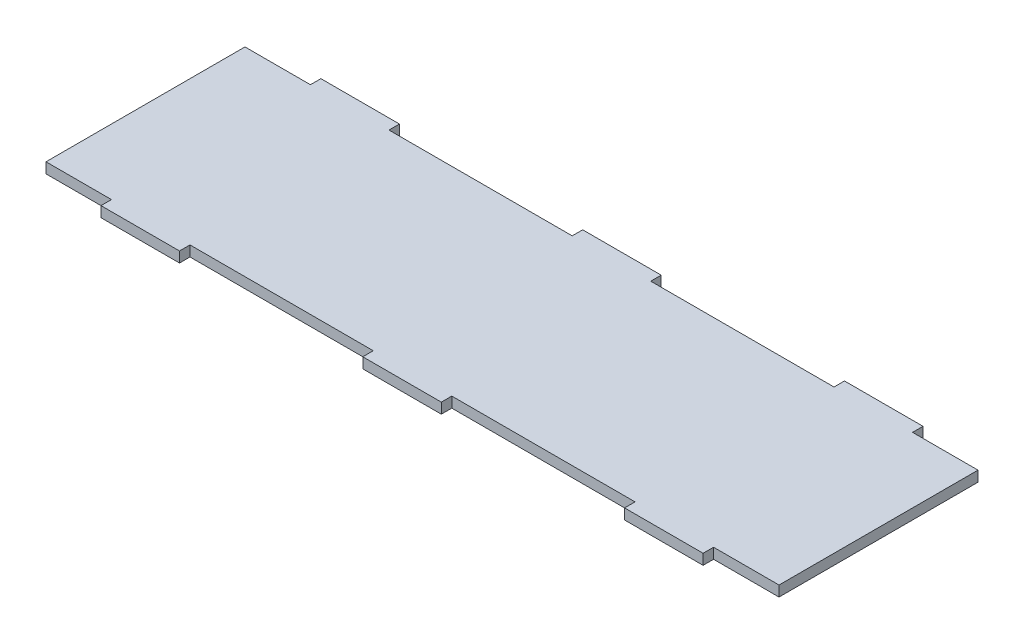
ISO-10303-21;
HEADER;
FILE_DESCRIPTION(('STEP AP214'),'2;1');
FILE_NAME('part.step','',(''),(''),'','','');
FILE_SCHEMA(('AUTOMOTIVE_DESIGN { 1 0 10303 214 1 1 1 1 }'));
ENDSEC;
DATA;
#1=APPLICATION_CONTEXT('core data for automotive mechanical design processes');
#2=APPLICATION_PROTOCOL_DEFINITION('international standard','automotive_design',2000,#1);
#3=PRODUCT_CONTEXT('',#1,'mechanical');
#4=PRODUCT('Part','Part','',(#3));
#5=PRODUCT_RELATED_PRODUCT_CATEGORY('part','',(#4));
#6=PRODUCT_DEFINITION_FORMATION('','',#4);
#7=PRODUCT_DEFINITION_CONTEXT('part definition',#1,'design');
#8=PRODUCT_DEFINITION('design','',#6,#7);
#9=PRODUCT_DEFINITION_SHAPE('','',#8);
#10=(LENGTH_UNIT() NAMED_UNIT(*) SI_UNIT(.MILLI.,.METRE.));
#11=(NAMED_UNIT(*) PLANE_ANGLE_UNIT() SI_UNIT($,.RADIAN.));
#12=(NAMED_UNIT(*) SI_UNIT($,.STERADIAN.) SOLID_ANGLE_UNIT());
#13=UNCERTAINTY_MEASURE_WITH_UNIT(LENGTH_MEASURE(1.E-05),#10,'distance_accuracy_value','');
#14=(GEOMETRIC_REPRESENTATION_CONTEXT(3) GLOBAL_UNCERTAINTY_ASSIGNED_CONTEXT((#13)) GLOBAL_UNIT_ASSIGNED_CONTEXT((#10,
#11,#12)) REPRESENTATION_CONTEXT('',''));
#15=CARTESIAN_POINT('',(0.,0.,0.));
#16=DIRECTION('',(0.,0.,1.));
#17=DIRECTION('',(1.,0.,0.));
#18=AXIS2_PLACEMENT_3D('',#15,#16,#17);
#19=CARTESIAN_POINT('',(15.,4.,-84.));
#20=DIRECTION('',(0.,0.,1.));
#21=DIRECTION('',(1.,0.,0.));
#22=AXIS2_PLACEMENT_3D('',#19,#20,#21);
#23=PLANE('',#22);
#24=DIRECTION('',(-1.,0.,0.));
#25=VECTOR('',#24,1.);
#26=CARTESIAN_POINT('',(15.,0.,-84.));
#27=LINE('',#26,#25);
#28=CARTESIAN_POINT('',(15.,0.,-84.));
#29=VERTEX_POINT('',#28);
#30=CARTESIAN_POINT('',(-15.,0.,-84.));
#31=VERTEX_POINT('',#30);
#32=EDGE_CURVE('E262',#29,#31,#27,.T.);
#33=ORIENTED_EDGE('',*,*,#32,.T.);
#34=DIRECTION('',(0.,-1.,0.));
#35=VECTOR('',#34,1.);
#36=CARTESIAN_POINT('',(-15.,4.,-84.));
#37=LINE('',#36,#35);
#38=CARTESIAN_POINT('',(-15.,4.,-84.));
#39=VERTEX_POINT('',#38);
#40=EDGE_CURVE('E11',#39,#31,#37,.T.);
#41=ORIENTED_EDGE('',*,*,#40,.F.);
#42=DIRECTION('',(-1.,0.,0.));
#43=VECTOR('',#42,1.);
#44=CARTESIAN_POINT('',(15.,4.,-84.));
#45=LINE('',#44,#43);
#46=CARTESIAN_POINT('',(15.,4.,-84.));
#47=VERTEX_POINT('',#46);
#48=EDGE_CURVE('E344',#47,#39,#45,.T.);
#49=ORIENTED_EDGE('',*,*,#48,.F.);
#50=DIRECTION('',(0.,-1.,0.));
#51=VECTOR('',#50,1.);
#52=CARTESIAN_POINT('',(15.,4.,-84.));
#53=LINE('',#52,#51);
#54=EDGE_CURVE('E258',#47,#29,#53,.T.);
#55=ORIENTED_EDGE('',*,*,#54,.T.);
#56=EDGE_LOOP('',(#33,#41,#49,#55));
#57=FACE_BOUND('',#56,.T.);
#58=ADVANCED_FACE('F40',(#57),#23,.F.);
#59=CARTESIAN_POINT('',(-15.,4.,-84.));
#60=DIRECTION('',(1.,0.,0.));
#61=DIRECTION('',(0.,0.,-1.));
#62=AXIS2_PLACEMENT_3D('',#59,#60,#61);
#63=PLANE('',#62);
#64=DIRECTION('',(0.,0.,1.));
#65=VECTOR('',#64,1.);
#66=CARTESIAN_POINT('',(-15.,0.,-84.));
#67=LINE('',#66,#65);
#68=CARTESIAN_POINT('',(-15.,0.,-80.));
#69=VERTEX_POINT('',#68);
#70=EDGE_CURVE('E266',#31,#69,#67,.T.);
#71=ORIENTED_EDGE('',*,*,#70,.T.);
#72=DIRECTION('',(0.,-1.,0.));
#73=VECTOR('',#72,1.);
#74=CARTESIAN_POINT('',(-15.,4.,-80.));
#75=LINE('',#74,#73);
#76=CARTESIAN_POINT('',(-15.,4.,-80.));
#77=VERTEX_POINT('',#76);
#78=EDGE_CURVE('E49',#77,#69,#75,.T.);
#79=ORIENTED_EDGE('',*,*,#78,.F.);
#80=DIRECTION('',(0.,0.,1.));
#81=VECTOR('',#80,1.);
#82=CARTESIAN_POINT('',(-15.,4.,-84.));
#83=LINE('',#82,#81);
#84=EDGE_CURVE('E160',#39,#77,#83,.T.);
#85=ORIENTED_EDGE('',*,*,#84,.F.);
#86=ORIENTED_EDGE('',*,*,#40,.T.);
#87=EDGE_LOOP('',(#71,#79,#85,#86));
#88=FACE_BOUND('',#87,.T.);
#89=ADVANCED_FACE('F573',(#88),#63,.F.);
#90=CARTESIAN_POINT('',(-15.,4.,-80.));
#91=DIRECTION('',(0.,0.,1.));
#92=DIRECTION('',(1.,0.,0.));
#93=AXIS2_PLACEMENT_3D('',#90,#91,#92);
#94=PLANE('',#93);
#95=DIRECTION('',(-1.,0.,0.));
#96=VECTOR('',#95,1.);
#97=CARTESIAN_POINT('',(-15.,0.,-80.));
#98=LINE('',#97,#96);
#99=CARTESIAN_POINT('',(-85.,0.,-80.));
#100=VERTEX_POINT('',#99);
#101=EDGE_CURVE('E269',#69,#100,#98,.T.);
#102=ORIENTED_EDGE('',*,*,#101,.T.);
#103=DIRECTION('',(0.,-1.,0.));
#104=VECTOR('',#103,1.);
#105=CARTESIAN_POINT('',(-85.,4.,-80.));
#106=LINE('',#105,#104);
#107=CARTESIAN_POINT('',(-85.,4.,-80.));
#108=VERTEX_POINT('',#107);
#109=EDGE_CURVE('E435',#108,#100,#106,.T.);
#110=ORIENTED_EDGE('',*,*,#109,.F.);
#111=DIRECTION('',(-1.,0.,0.));
#112=VECTOR('',#111,1.);
#113=CARTESIAN_POINT('',(-15.,4.,-80.));
#114=LINE('',#113,#112);
#115=EDGE_CURVE('E446',#77,#108,#114,.T.);
#116=ORIENTED_EDGE('',*,*,#115,.F.);
#117=ORIENTED_EDGE('',*,*,#78,.T.);
#118=EDGE_LOOP('',(#102,#110,#116,#117));
#119=FACE_BOUND('',#118,.T.);
#120=ADVANCED_FACE('F444',(#119),#94,.F.);
#121=CARTESIAN_POINT('',(-85.,4.,-80.));
#122=DIRECTION('',(-1.,0.,0.));
#123=DIRECTION('',(0.,0.,1.));
#124=AXIS2_PLACEMENT_3D('',#121,#122,#123);
#125=PLANE('',#124);
#126=DIRECTION('',(0.,0.,-1.));
#127=VECTOR('',#126,1.);
#128=CARTESIAN_POINT('',(-85.,0.,-80.));
#129=LINE('',#128,#127);
#130=CARTESIAN_POINT('',(-85.,0.,-84.));
#131=VERTEX_POINT('',#130);
#132=EDGE_CURVE('E272',#100,#131,#129,.T.);
#133=ORIENTED_EDGE('',*,*,#132,.T.);
#134=DIRECTION('',(0.,-1.,0.));
#135=VECTOR('',#134,1.);
#136=CARTESIAN_POINT('',(-85.,4.,-84.));
#137=LINE('',#136,#135);
#138=CARTESIAN_POINT('',(-85.,4.,-84.));
#139=VERTEX_POINT('',#138);
#140=EDGE_CURVE('E431',#139,#131,#137,.T.);
#141=ORIENTED_EDGE('',*,*,#140,.F.);
#142=DIRECTION('',(0.,0.,-1.));
#143=VECTOR('',#142,1.);
#144=CARTESIAN_POINT('',(-85.,4.,-80.));
#145=LINE('',#144,#143);
#146=EDGE_CURVE('E465',#108,#139,#145,.T.);
#147=ORIENTED_EDGE('',*,*,#146,.F.);
#148=ORIENTED_EDGE('',*,*,#109,.T.);
#149=EDGE_LOOP('',(#133,#141,#147,#148));
#150=FACE_BOUND('',#149,.T.);
#151=ADVANCED_FACE('F455',(#150),#125,.F.);
#152=CARTESIAN_POINT('',(-85.,4.,-84.));
#153=DIRECTION('',(0.,0.,1.));
#154=DIRECTION('',(1.,0.,0.));
#155=AXIS2_PLACEMENT_3D('',#152,#153,#154);
#156=PLANE('',#155);
#157=DIRECTION('',(-1.,0.,0.));
#158=VECTOR('',#157,1.);
#159=CARTESIAN_POINT('',(-85.,0.,-84.));
#160=LINE('',#159,#158);
#161=CARTESIAN_POINT('',(-115.,0.,-84.));
#162=VERTEX_POINT('',#161);
#163=EDGE_CURVE('E275',#131,#162,#160,.T.);
#164=ORIENTED_EDGE('',*,*,#163,.T.);
#165=DIRECTION('',(0.,-1.,0.));
#166=VECTOR('',#165,1.);
#167=CARTESIAN_POINT('',(-115.,4.,-84.));
#168=LINE('',#167,#166);
#169=CARTESIAN_POINT('',(-115.,4.,-84.));
#170=VERTEX_POINT('',#169);
#171=EDGE_CURVE('E427',#170,#162,#168,.T.);
#172=ORIENTED_EDGE('',*,*,#171,.F.);
#173=DIRECTION('',(-1.,0.,0.));
#174=VECTOR('',#173,1.);
#175=CARTESIAN_POINT('',(-85.,4.,-84.));
#176=LINE('',#175,#174);
#177=EDGE_CURVE('E461',#139,#170,#176,.T.);
#178=ORIENTED_EDGE('',*,*,#177,.F.);
#179=ORIENTED_EDGE('',*,*,#140,.T.);
#180=EDGE_LOOP('',(#164,#172,#178,#179));
#181=FACE_BOUND('',#180,.T.);
#182=ADVANCED_FACE('F459',(#181),#156,.F.);
#183=CARTESIAN_POINT('',(-115.,4.,-84.));
#184=DIRECTION('',(1.,0.,0.));
#185=DIRECTION('',(0.,0.,-1.));
#186=AXIS2_PLACEMENT_3D('',#183,#184,#185);
#187=PLANE('',#186);
#188=DIRECTION('',(0.,0.,1.));
#189=VECTOR('',#188,1.);
#190=CARTESIAN_POINT('',(-115.,0.,-84.));
#191=LINE('',#190,#189);
#192=CARTESIAN_POINT('',(-115.,0.,-80.));
#193=VERTEX_POINT('',#192);
#194=EDGE_CURVE('E278',#162,#193,#191,.T.);
#195=ORIENTED_EDGE('',*,*,#194,.T.);
#196=DIRECTION('',(0.,-1.,0.));
#197=VECTOR('',#196,1.);
#198=CARTESIAN_POINT('',(-115.,4.,-80.));
#199=LINE('',#198,#197);
#200=CARTESIAN_POINT('',(-115.,4.,-80.));
#201=VERTEX_POINT('',#200);
#202=EDGE_CURVE('E423',#201,#193,#199,.T.);
#203=ORIENTED_EDGE('',*,*,#202,.F.);
#204=DIRECTION('',(0.,0.,1.));
#205=VECTOR('',#204,1.);
#206=CARTESIAN_POINT('',(-115.,4.,-84.));
#207=LINE('',#206,#205);
#208=EDGE_CURVE('E464',#170,#201,#207,.T.);
#209=ORIENTED_EDGE('',*,*,#208,.F.);
#210=ORIENTED_EDGE('',*,*,#171,.T.);
#211=EDGE_LOOP('',(#195,#203,#209,#210));
#212=FACE_BOUND('',#211,.T.);
#213=ADVANCED_FACE('F586',(#212),#187,.F.);
#214=CARTESIAN_POINT('',(-115.,4.,-80.));
#215=DIRECTION('',(0.,0.,1.));
#216=DIRECTION('',(1.,0.,0.));
#217=AXIS2_PLACEMENT_3D('',#214,#215,#216);
#218=PLANE('',#217);
#219=DIRECTION('',(-1.,0.,0.));
#220=VECTOR('',#219,1.);
#221=CARTESIAN_POINT('',(-115.,0.,-80.));
#222=LINE('',#221,#220);
#223=CARTESIAN_POINT('',(-140.,0.,-80.));
#224=VERTEX_POINT('',#223);
#225=EDGE_CURVE('E281',#193,#224,#222,.T.);
#226=ORIENTED_EDGE('',*,*,#225,.T.);
#227=DIRECTION('',(0.,-1.,0.));
#228=VECTOR('',#227,1.);
#229=CARTESIAN_POINT('',(-140.,4.,-80.));
#230=LINE('',#229,#228);
#231=CARTESIAN_POINT('',(-140.,4.,-80.));
#232=VERTEX_POINT('',#231);
#233=EDGE_CURVE('E419',#232,#224,#230,.T.);
#234=ORIENTED_EDGE('',*,*,#233,.F.);
#235=DIRECTION('',(-1.,0.,0.));
#236=VECTOR('',#235,1.);
#237=CARTESIAN_POINT('',(-115.,4.,-80.));
#238=LINE('',#237,#236);
#239=EDGE_CURVE('E470',#201,#232,#238,.T.);
#240=ORIENTED_EDGE('',*,*,#239,.F.);
#241=ORIENTED_EDGE('',*,*,#202,.T.);
#242=EDGE_LOOP('',(#226,#234,#240,#241));
#243=FACE_BOUND('',#242,.T.);
#244=ADVANCED_FACE('F589',(#243),#218,.F.);
#245=CARTESIAN_POINT('',(-140.,4.,-80.));
#246=DIRECTION('',(1.,0.,0.));
#247=DIRECTION('',(0.,0.,-1.));
#248=AXIS2_PLACEMENT_3D('',#245,#246,#247);
#249=PLANE('',#248);
#250=DIRECTION('',(0.,0.,1.));
#251=VECTOR('',#250,1.);
#252=CARTESIAN_POINT('',(-140.,0.,-80.));
#253=LINE('',#252,#251);
#254=CARTESIAN_POINT('',(-140.,0.,-3.99999999999998));
#255=VERTEX_POINT('',#254);
#256=EDGE_CURVE('E284',#224,#255,#253,.T.);
#257=ORIENTED_EDGE('',*,*,#256,.T.);
#258=DIRECTION('',(0.,-1.,0.));
#259=VECTOR('',#258,1.);
#260=CARTESIAN_POINT('',(-140.,4.,-3.99999999999998));
#261=LINE('',#260,#259);
#262=CARTESIAN_POINT('',(-140.,4.,-3.99999999999998));
#263=VERTEX_POINT('',#262);
#264=EDGE_CURVE('E415',#263,#255,#261,.T.);
#265=ORIENTED_EDGE('',*,*,#264,.F.);
#266=DIRECTION('',(0.,0.,1.));
#267=VECTOR('',#266,1.);
#268=CARTESIAN_POINT('',(-140.,4.,-80.));
#269=LINE('',#268,#267);
#270=EDGE_CURVE('E477',#232,#263,#269,.T.);
#271=ORIENTED_EDGE('',*,*,#270,.F.);
#272=ORIENTED_EDGE('',*,*,#233,.T.);
#273=EDGE_LOOP('',(#257,#265,#271,#272));
#274=FACE_BOUND('',#273,.T.);
#275=ADVANCED_FACE('F593',(#274),#249,.F.);
#276=CARTESIAN_POINT('',(-115.,4.,-3.99999999999999));
#277=DIRECTION('',(0.,0.,-1.));
#278=DIRECTION('',(-1.,0.,0.));
#279=AXIS2_PLACEMENT_3D('',#276,#277,#278);
#280=PLANE('',#279);
#281=DIRECTION('',(1.,0.,0.));
#282=VECTOR('',#281,1.);
#283=CARTESIAN_POINT('',(-115.,0.,-3.99999999999999));
#284=LINE('',#283,#282);
#285=CARTESIAN_POINT('',(-115.,0.,-3.99999999999999));
#286=VERTEX_POINT('',#285);
#287=EDGE_CURVE('E287',#255,#286,#284,.T.);
#288=ORIENTED_EDGE('',*,*,#287,.T.);
#289=DIRECTION('',(0.,-1.,0.));
#290=VECTOR('',#289,1.);
#291=CARTESIAN_POINT('',(-115.,4.,-3.99999999999999));
#292=LINE('',#291,#290);
#293=CARTESIAN_POINT('',(-115.,4.,-3.99999999999999));
#294=VERTEX_POINT('',#293);
#295=EDGE_CURVE('E411',#294,#286,#292,.T.);
#296=ORIENTED_EDGE('',*,*,#295,.F.);
#297=DIRECTION('',(1.,0.,0.));
#298=VECTOR('',#297,1.);
#299=CARTESIAN_POINT('',(-115.,4.,-3.99999999999999));
#300=LINE('',#299,#298);
#301=EDGE_CURVE('E480',#263,#294,#300,.T.);
#302=ORIENTED_EDGE('',*,*,#301,.F.);
#303=ORIENTED_EDGE('',*,*,#264,.T.);
#304=EDGE_LOOP('',(#288,#296,#302,#303));
#305=FACE_BOUND('',#304,.T.);
#306=ADVANCED_FACE('F597',(#305),#280,.F.);
#307=CARTESIAN_POINT('',(-115.,4.,0.));
#308=DIRECTION('',(1.,0.,0.));
#309=DIRECTION('',(0.,0.,-1.));
#310=AXIS2_PLACEMENT_3D('',#307,#308,#309);
#311=PLANE('',#310);
#312=DIRECTION('',(0.,0.,1.));
#313=VECTOR('',#312,1.);
#314=CARTESIAN_POINT('',(-115.,0.,0.));
#315=LINE('',#314,#313);
#316=CARTESIAN_POINT('',(-115.,0.,0.));
#317=VERTEX_POINT('',#316);
#318=EDGE_CURVE('E290',#286,#317,#315,.T.);
#319=ORIENTED_EDGE('',*,*,#318,.T.);
#320=DIRECTION('',(0.,-1.,0.));
#321=VECTOR('',#320,1.);
#322=CARTESIAN_POINT('',(-115.,4.,0.));
#323=LINE('',#322,#321);
#324=CARTESIAN_POINT('',(-115.,4.,0.));
#325=VERTEX_POINT('',#324);
#326=EDGE_CURVE('E407',#325,#317,#323,.T.);
#327=ORIENTED_EDGE('',*,*,#326,.F.);
#328=DIRECTION('',(0.,0.,1.));
#329=VECTOR('',#328,1.);
#330=CARTESIAN_POINT('',(-115.,4.,0.));
#331=LINE('',#330,#329);
#332=EDGE_CURVE('E483',#294,#325,#331,.T.);
#333=ORIENTED_EDGE('',*,*,#332,.F.);
#334=ORIENTED_EDGE('',*,*,#295,.T.);
#335=EDGE_LOOP('',(#319,#327,#333,#334));
#336=FACE_BOUND('',#335,.T.);
#337=ADVANCED_FACE('F601',(#336),#311,.F.);
#338=CARTESIAN_POINT('',(-85.,4.,0.));
#339=DIRECTION('',(0.,0.,-1.));
#340=DIRECTION('',(-1.,0.,0.));
#341=AXIS2_PLACEMENT_3D('',#338,#339,#340);
#342=PLANE('',#341);
#343=DIRECTION('',(1.,0.,0.));
#344=VECTOR('',#343,1.);
#345=CARTESIAN_POINT('',(-85.,0.,0.));
#346=LINE('',#345,#344);
#347=CARTESIAN_POINT('',(-85.,0.,0.));
#348=VERTEX_POINT('',#347);
#349=EDGE_CURVE('E293',#317,#348,#346,.T.);
#350=ORIENTED_EDGE('',*,*,#349,.T.);
#351=DIRECTION('',(0.,-1.,0.));
#352=VECTOR('',#351,1.);
#353=CARTESIAN_POINT('',(-85.,4.,0.));
#354=LINE('',#353,#352);
#355=CARTESIAN_POINT('',(-85.,4.,0.));
#356=VERTEX_POINT('',#355);
#357=EDGE_CURVE('E403',#356,#348,#354,.T.);
#358=ORIENTED_EDGE('',*,*,#357,.F.);
#359=DIRECTION('',(1.,0.,0.));
#360=VECTOR('',#359,1.);
#361=CARTESIAN_POINT('',(-85.,4.,0.));
#362=LINE('',#361,#360);
#363=EDGE_CURVE('E486',#325,#356,#362,.T.);
#364=ORIENTED_EDGE('',*,*,#363,.F.);
#365=ORIENTED_EDGE('',*,*,#326,.T.);
#366=EDGE_LOOP('',(#350,#358,#364,#365));
#367=FACE_BOUND('',#366,.T.);
#368=ADVANCED_FACE('F605',(#367),#342,.F.);
#369=CARTESIAN_POINT('',(-85.,4.,-3.99999999999999));
#370=DIRECTION('',(-1.,0.,0.));
#371=DIRECTION('',(0.,0.,1.));
#372=AXIS2_PLACEMENT_3D('',#369,#370,#371);
#373=PLANE('',#372);
#374=DIRECTION('',(0.,0.,-1.));
#375=VECTOR('',#374,1.);
#376=CARTESIAN_POINT('',(-85.,0.,-3.99999999999999));
#377=LINE('',#376,#375);
#378=CARTESIAN_POINT('',(-85.,0.,-3.99999999999999));
#379=VERTEX_POINT('',#378);
#380=EDGE_CURVE('E296',#348,#379,#377,.T.);
#381=ORIENTED_EDGE('',*,*,#380,.T.);
#382=DIRECTION('',(0.,-1.,0.));
#383=VECTOR('',#382,1.);
#384=CARTESIAN_POINT('',(-85.,4.,-3.99999999999999));
#385=LINE('',#384,#383);
#386=CARTESIAN_POINT('',(-85.,4.,-3.99999999999999));
#387=VERTEX_POINT('',#386);
#388=EDGE_CURVE('E399',#387,#379,#385,.T.);
#389=ORIENTED_EDGE('',*,*,#388,.F.);
#390=DIRECTION('',(0.,0.,-1.));
#391=VECTOR('',#390,1.);
#392=CARTESIAN_POINT('',(-85.,4.,-3.99999999999999));
#393=LINE('',#392,#391);
#394=EDGE_CURVE('E489',#356,#387,#393,.T.);
#395=ORIENTED_EDGE('',*,*,#394,.F.);
#396=ORIENTED_EDGE('',*,*,#357,.T.);
#397=EDGE_LOOP('',(#381,#389,#395,#396));
#398=FACE_BOUND('',#397,.T.);
#399=ADVANCED_FACE('F609',(#398),#373,.F.);
#400=CARTESIAN_POINT('',(-15.,4.,-4.));
#401=DIRECTION('',(0.,0.,-1.));
#402=DIRECTION('',(-1.,0.,0.));
#403=AXIS2_PLACEMENT_3D('',#400,#401,#402);
#404=PLANE('',#403);
#405=DIRECTION('',(1.,0.,0.));
#406=VECTOR('',#405,1.);
#407=CARTESIAN_POINT('',(-15.,0.,-4.));
#408=LINE('',#407,#406);
#409=CARTESIAN_POINT('',(-15.,0.,-4.));
#410=VERTEX_POINT('',#409);
#411=EDGE_CURVE('E299',#379,#410,#408,.T.);
#412=ORIENTED_EDGE('',*,*,#411,.T.);
#413=DIRECTION('',(0.,-1.,0.));
#414=VECTOR('',#413,1.);
#415=CARTESIAN_POINT('',(-15.,4.,-4.));
#416=LINE('',#415,#414);
#417=CARTESIAN_POINT('',(-15.,4.,-4.));
#418=VERTEX_POINT('',#417);
#419=EDGE_CURVE('E395',#418,#410,#416,.T.);
#420=ORIENTED_EDGE('',*,*,#419,.F.);
#421=DIRECTION('',(1.,0.,0.));
#422=VECTOR('',#421,1.);
#423=CARTESIAN_POINT('',(-15.,4.,-4.));
#424=LINE('',#423,#422);
#425=EDGE_CURVE('E492',#387,#418,#424,.T.);
#426=ORIENTED_EDGE('',*,*,#425,.F.);
#427=ORIENTED_EDGE('',*,*,#388,.T.);
#428=EDGE_LOOP('',(#412,#420,#426,#427));
#429=FACE_BOUND('',#428,.T.);
#430=ADVANCED_FACE('F613',(#429),#404,.F.);
#431=CARTESIAN_POINT('',(-15.,4.,0.));
#432=DIRECTION('',(1.,0.,0.));
#433=DIRECTION('',(0.,0.,-1.));
#434=AXIS2_PLACEMENT_3D('',#431,#432,#433);
#435=PLANE('',#434);
#436=DIRECTION('',(0.,0.,1.));
#437=VECTOR('',#436,1.);
#438=CARTESIAN_POINT('',(-15.,0.,0.));
#439=LINE('',#438,#437);
#440=CARTESIAN_POINT('',(-15.,0.,0.));
#441=VERTEX_POINT('',#440);
#442=EDGE_CURVE('E302',#410,#441,#439,.T.);
#443=ORIENTED_EDGE('',*,*,#442,.T.);
#444=DIRECTION('',(0.,-1.,0.));
#445=VECTOR('',#444,1.);
#446=CARTESIAN_POINT('',(-15.,4.,0.));
#447=LINE('',#446,#445);
#448=CARTESIAN_POINT('',(-15.,4.,0.));
#449=VERTEX_POINT('',#448);
#450=EDGE_CURVE('E391',#449,#441,#447,.T.);
#451=ORIENTED_EDGE('',*,*,#450,.F.);
#452=DIRECTION('',(0.,0.,1.));
#453=VECTOR('',#452,1.);
#454=CARTESIAN_POINT('',(-15.,4.,0.));
#455=LINE('',#454,#453);
#456=EDGE_CURVE('E495',#418,#449,#455,.T.);
#457=ORIENTED_EDGE('',*,*,#456,.F.);
#458=ORIENTED_EDGE('',*,*,#419,.T.);
#459=EDGE_LOOP('',(#443,#451,#457,#458));
#460=FACE_BOUND('',#459,.T.);
#461=ADVANCED_FACE('F617',(#460),#435,.F.);
#462=CARTESIAN_POINT('',(15.,4.,0.));
#463=DIRECTION('',(0.,0.,-1.));
#464=DIRECTION('',(-1.,0.,0.));
#465=AXIS2_PLACEMENT_3D('',#462,#463,#464);
#466=PLANE('',#465);
#467=DIRECTION('',(1.,0.,0.));
#468=VECTOR('',#467,1.);
#469=CARTESIAN_POINT('',(15.,0.,0.));
#470=LINE('',#469,#468);
#471=CARTESIAN_POINT('',(15.,0.,0.));
#472=VERTEX_POINT('',#471);
#473=EDGE_CURVE('E305',#441,#472,#470,.T.);
#474=ORIENTED_EDGE('',*,*,#473,.T.);
#475=DIRECTION('',(0.,-1.,0.));
#476=VECTOR('',#475,1.);
#477=CARTESIAN_POINT('',(15.,4.,0.));
#478=LINE('',#477,#476);
#479=CARTESIAN_POINT('',(15.,4.,0.));
#480=VERTEX_POINT('',#479);
#481=EDGE_CURVE('E387',#480,#472,#478,.T.);
#482=ORIENTED_EDGE('',*,*,#481,.F.);
#483=DIRECTION('',(1.,0.,0.));
#484=VECTOR('',#483,1.);
#485=CARTESIAN_POINT('',(15.,4.,0.));
#486=LINE('',#485,#484);
#487=EDGE_CURVE('E498',#449,#480,#486,.T.);
#488=ORIENTED_EDGE('',*,*,#487,.F.);
#489=ORIENTED_EDGE('',*,*,#450,.T.);
#490=EDGE_LOOP('',(#474,#482,#488,#489));
#491=FACE_BOUND('',#490,.T.);
#492=ADVANCED_FACE('F621',(#491),#466,.F.);
#493=CARTESIAN_POINT('',(15.,4.,0.));
#494=DIRECTION('',(-1.,0.,0.));
#495=DIRECTION('',(0.,0.,1.));
#496=AXIS2_PLACEMENT_3D('',#493,#494,#495);
#497=PLANE('',#496);
#498=DIRECTION('',(0.,0.,-1.));
#499=VECTOR('',#498,1.);
#500=CARTESIAN_POINT('',(15.,0.,0.));
#501=LINE('',#500,#499);
#502=CARTESIAN_POINT('',(15.,0.,-4.));
#503=VERTEX_POINT('',#502);
#504=EDGE_CURVE('E308',#472,#503,#501,.T.);
#505=ORIENTED_EDGE('',*,*,#504,.T.);
#506=DIRECTION('',(0.,-1.,0.));
#507=VECTOR('',#506,1.);
#508=CARTESIAN_POINT('',(15.,4.,-4.));
#509=LINE('',#508,#507);
#510=CARTESIAN_POINT('',(15.,4.,-4.));
#511=VERTEX_POINT('',#510);
#512=EDGE_CURVE('E383',#511,#503,#509,.T.);
#513=ORIENTED_EDGE('',*,*,#512,.F.);
#514=DIRECTION('',(0.,0.,-1.));
#515=VECTOR('',#514,1.);
#516=CARTESIAN_POINT('',(15.,4.,0.));
#517=LINE('',#516,#515);
#518=EDGE_CURVE('E501',#480,#511,#517,.T.);
#519=ORIENTED_EDGE('',*,*,#518,.F.);
#520=ORIENTED_EDGE('',*,*,#481,.T.);
#521=EDGE_LOOP('',(#505,#513,#519,#520));
#522=FACE_BOUND('',#521,.T.);
#523=ADVANCED_FACE('F625',(#522),#497,.F.);
#524=CARTESIAN_POINT('',(15.,4.,-4.));
#525=DIRECTION('',(0.,0.,-1.));
#526=DIRECTION('',(-1.,0.,0.));
#527=AXIS2_PLACEMENT_3D('',#524,#525,#526);
#528=PLANE('',#527);
#529=DIRECTION('',(1.,0.,0.));
#530=VECTOR('',#529,1.);
#531=CARTESIAN_POINT('',(15.,0.,-4.));
#532=LINE('',#531,#530);
#533=CARTESIAN_POINT('',(85.,0.,-3.99999999999999));
#534=VERTEX_POINT('',#533);
#535=EDGE_CURVE('E311',#503,#534,#532,.T.);
#536=ORIENTED_EDGE('',*,*,#535,.T.);
#537=DIRECTION('',(0.,-1.,0.));
#538=VECTOR('',#537,1.);
#539=CARTESIAN_POINT('',(85.,4.,-3.99999999999999));
#540=LINE('',#539,#538);
#541=CARTESIAN_POINT('',(85.,4.,-3.99999999999999));
#542=VERTEX_POINT('',#541);
#543=EDGE_CURVE('E379',#542,#534,#540,.T.);
#544=ORIENTED_EDGE('',*,*,#543,.F.);
#545=DIRECTION('',(1.,0.,0.));
#546=VECTOR('',#545,1.);
#547=CARTESIAN_POINT('',(15.,4.,-4.));
#548=LINE('',#547,#546);
#549=EDGE_CURVE('E504',#511,#542,#548,.T.);
#550=ORIENTED_EDGE('',*,*,#549,.F.);
#551=ORIENTED_EDGE('',*,*,#512,.T.);
#552=EDGE_LOOP('',(#536,#544,#550,#551));
#553=FACE_BOUND('',#552,.T.);
#554=ADVANCED_FACE('F629',(#553),#528,.F.);
#555=CARTESIAN_POINT('',(85.,4.,-3.99999999999999));
#556=DIRECTION('',(1.,0.,0.));
#557=DIRECTION('',(0.,0.,-1.));
#558=AXIS2_PLACEMENT_3D('',#555,#556,#557);
#559=PLANE('',#558);
#560=DIRECTION('',(0.,0.,1.));
#561=VECTOR('',#560,1.);
#562=CARTESIAN_POINT('',(85.,0.,-3.99999999999999));
#563=LINE('',#562,#561);
#564=CARTESIAN_POINT('',(85.,0.,0.));
#565=VERTEX_POINT('',#564);
#566=EDGE_CURVE('E314',#534,#565,#563,.T.);
#567=ORIENTED_EDGE('',*,*,#566,.T.);
#568=DIRECTION('',(0.,-1.,0.));
#569=VECTOR('',#568,1.);
#570=CARTESIAN_POINT('',(85.,4.,0.));
#571=LINE('',#570,#569);
#572=CARTESIAN_POINT('',(85.,4.,0.));
#573=VERTEX_POINT('',#572);
#574=EDGE_CURVE('E375',#573,#565,#571,.T.);
#575=ORIENTED_EDGE('',*,*,#574,.F.);
#576=DIRECTION('',(0.,0.,1.));
#577=VECTOR('',#576,1.);
#578=CARTESIAN_POINT('',(85.,4.,-3.99999999999999));
#579=LINE('',#578,#577);
#580=EDGE_CURVE('E507',#542,#573,#579,.T.);
#581=ORIENTED_EDGE('',*,*,#580,.F.);
#582=ORIENTED_EDGE('',*,*,#543,.T.);
#583=EDGE_LOOP('',(#567,#575,#581,#582));
#584=FACE_BOUND('',#583,.T.);
#585=ADVANCED_FACE('F633',(#584),#559,.F.);
#586=CARTESIAN_POINT('',(85.,4.,0.));
#587=DIRECTION('',(0.,0.,-1.));
#588=DIRECTION('',(-1.,0.,0.));
#589=AXIS2_PLACEMENT_3D('',#586,#587,#588);
#590=PLANE('',#589);
#591=DIRECTION('',(1.,0.,0.));
#592=VECTOR('',#591,1.);
#593=CARTESIAN_POINT('',(85.,0.,0.));
#594=LINE('',#593,#592);
#595=CARTESIAN_POINT('',(115.,0.,0.));
#596=VERTEX_POINT('',#595);
#597=EDGE_CURVE('E317',#565,#596,#594,.T.);
#598=ORIENTED_EDGE('',*,*,#597,.T.);
#599=DIRECTION('',(0.,-1.,0.));
#600=VECTOR('',#599,1.);
#601=CARTESIAN_POINT('',(115.,4.,0.));
#602=LINE('',#601,#600);
#603=CARTESIAN_POINT('',(115.,4.,0.));
#604=VERTEX_POINT('',#603);
#605=EDGE_CURVE('E371',#604,#596,#602,.T.);
#606=ORIENTED_EDGE('',*,*,#605,.F.);
#607=DIRECTION('',(1.,0.,0.));
#608=VECTOR('',#607,1.);
#609=CARTESIAN_POINT('',(85.,4.,0.));
#610=LINE('',#609,#608);
#611=EDGE_CURVE('E510',#573,#604,#610,.T.);
#612=ORIENTED_EDGE('',*,*,#611,.F.);
#613=ORIENTED_EDGE('',*,*,#574,.T.);
#614=EDGE_LOOP('',(#598,#606,#612,#613));
#615=FACE_BOUND('',#614,.T.);
#616=ADVANCED_FACE('F637',(#615),#590,.F.);
#617=CARTESIAN_POINT('',(115.,4.,0.));
#618=DIRECTION('',(-1.,0.,0.));
#619=DIRECTION('',(0.,0.,1.));
#620=AXIS2_PLACEMENT_3D('',#617,#618,#619);
#621=PLANE('',#620);
#622=DIRECTION('',(0.,0.,-1.));
#623=VECTOR('',#622,1.);
#624=CARTESIAN_POINT('',(115.,0.,0.));
#625=LINE('',#624,#623);
#626=CARTESIAN_POINT('',(115.,0.,-3.99999999999999));
#627=VERTEX_POINT('',#626);
#628=EDGE_CURVE('E320',#596,#627,#625,.T.);
#629=ORIENTED_EDGE('',*,*,#628,.T.);
#630=DIRECTION('',(0.,-1.,0.));
#631=VECTOR('',#630,1.);
#632=CARTESIAN_POINT('',(115.,4.,-3.99999999999999));
#633=LINE('',#632,#631);
#634=CARTESIAN_POINT('',(115.,4.,-3.99999999999999));
#635=VERTEX_POINT('',#634);
#636=EDGE_CURVE('E367',#635,#627,#633,.T.);
#637=ORIENTED_EDGE('',*,*,#636,.F.);
#638=DIRECTION('',(0.,0.,-1.));
#639=VECTOR('',#638,1.);
#640=CARTESIAN_POINT('',(115.,4.,0.));
#641=LINE('',#640,#639);
#642=EDGE_CURVE('E513',#604,#635,#641,.T.);
#643=ORIENTED_EDGE('',*,*,#642,.F.);
#644=ORIENTED_EDGE('',*,*,#605,.T.);
#645=EDGE_LOOP('',(#629,#637,#643,#644));
#646=FACE_BOUND('',#645,.T.);
#647=ADVANCED_FACE('F641',(#646),#621,.F.);
#648=CARTESIAN_POINT('',(115.,4.,-3.99999999999999));
#649=DIRECTION('',(0.,0.,-1.));
#650=DIRECTION('',(-1.,0.,0.));
#651=AXIS2_PLACEMENT_3D('',#648,#649,#650);
#652=PLANE('',#651);
#653=DIRECTION('',(1.,0.,0.));
#654=VECTOR('',#653,1.);
#655=CARTESIAN_POINT('',(115.,0.,-3.99999999999999));
#656=LINE('',#655,#654);
#657=CARTESIAN_POINT('',(140.,0.,-3.99999999999998));
#658=VERTEX_POINT('',#657);
#659=EDGE_CURVE('E323',#627,#658,#656,.T.);
#660=ORIENTED_EDGE('',*,*,#659,.T.);
#661=DIRECTION('',(0.,-1.,0.));
#662=VECTOR('',#661,1.);
#663=CARTESIAN_POINT('',(140.,4.,-3.99999999999998));
#664=LINE('',#663,#662);
#665=CARTESIAN_POINT('',(140.,4.,-3.99999999999998));
#666=VERTEX_POINT('',#665);
#667=EDGE_CURVE('E363',#666,#658,#664,.T.);
#668=ORIENTED_EDGE('',*,*,#667,.F.);
#669=DIRECTION('',(1.,0.,0.));
#670=VECTOR('',#669,1.);
#671=CARTESIAN_POINT('',(115.,4.,-3.99999999999999));
#672=LINE('',#671,#670);
#673=EDGE_CURVE('E516',#635,#666,#672,.T.);
#674=ORIENTED_EDGE('',*,*,#673,.F.);
#675=ORIENTED_EDGE('',*,*,#636,.T.);
#676=EDGE_LOOP('',(#660,#668,#674,#675));
#677=FACE_BOUND('',#676,.T.);
#678=ADVANCED_FACE('F645',(#677),#652,.F.);
#679=CARTESIAN_POINT('',(140.,4.,-80.));
#680=DIRECTION('',(-1.,0.,0.));
#681=DIRECTION('',(0.,0.,1.));
#682=AXIS2_PLACEMENT_3D('',#679,#680,#681);
#683=PLANE('',#682);
#684=DIRECTION('',(0.,0.,-1.));
#685=VECTOR('',#684,1.);
#686=CARTESIAN_POINT('',(140.,0.,-80.));
#687=LINE('',#686,#685);
#688=CARTESIAN_POINT('',(140.,0.,-80.));
#689=VERTEX_POINT('',#688);
#690=EDGE_CURVE('E326',#658,#689,#687,.T.);
#691=ORIENTED_EDGE('',*,*,#690,.T.);
#692=DIRECTION('',(0.,-1.,0.));
#693=VECTOR('',#692,1.);
#694=CARTESIAN_POINT('',(140.,4.,-80.));
#695=LINE('',#694,#693);
#696=CARTESIAN_POINT('',(140.,4.,-80.));
#697=VERTEX_POINT('',#696);
#698=EDGE_CURVE('E359',#697,#689,#695,.T.);
#699=ORIENTED_EDGE('',*,*,#698,.F.);
#700=DIRECTION('',(0.,0.,-1.));
#701=VECTOR('',#700,1.);
#702=CARTESIAN_POINT('',(140.,4.,-80.));
#703=LINE('',#702,#701);
#704=EDGE_CURVE('E519',#666,#697,#703,.T.);
#705=ORIENTED_EDGE('',*,*,#704,.F.);
#706=ORIENTED_EDGE('',*,*,#667,.T.);
#707=EDGE_LOOP('',(#691,#699,#705,#706));
#708=FACE_BOUND('',#707,.T.);
#709=ADVANCED_FACE('F649',(#708),#683,.F.);
#710=CARTESIAN_POINT('',(115.,4.,-80.));
#711=DIRECTION('',(0.,0.,1.));
#712=DIRECTION('',(1.,0.,0.));
#713=AXIS2_PLACEMENT_3D('',#710,#711,#712);
#714=PLANE('',#713);
#715=DIRECTION('',(-1.,0.,0.));
#716=VECTOR('',#715,1.);
#717=CARTESIAN_POINT('',(115.,0.,-80.));
#718=LINE('',#717,#716);
#719=CARTESIAN_POINT('',(115.,0.,-80.));
#720=VERTEX_POINT('',#719);
#721=EDGE_CURVE('E329',#689,#720,#718,.T.);
#722=ORIENTED_EDGE('',*,*,#721,.T.);
#723=DIRECTION('',(0.,-1.,0.));
#724=VECTOR('',#723,1.);
#725=CARTESIAN_POINT('',(115.,4.,-80.));
#726=LINE('',#725,#724);
#727=CARTESIAN_POINT('',(115.,4.,-80.));
#728=VERTEX_POINT('',#727);
#729=EDGE_CURVE('E355',#728,#720,#726,.T.);
#730=ORIENTED_EDGE('',*,*,#729,.F.);
#731=DIRECTION('',(-1.,0.,0.));
#732=VECTOR('',#731,1.);
#733=CARTESIAN_POINT('',(115.,4.,-80.));
#734=LINE('',#733,#732);
#735=EDGE_CURVE('E522',#697,#728,#734,.T.);
#736=ORIENTED_EDGE('',*,*,#735,.F.);
#737=ORIENTED_EDGE('',*,*,#698,.T.);
#738=EDGE_LOOP('',(#722,#730,#736,#737));
#739=FACE_BOUND('',#738,.T.);
#740=ADVANCED_FACE('F653',(#739),#714,.F.);
#741=CARTESIAN_POINT('',(115.,4.,-84.));
#742=DIRECTION('',(-1.,0.,0.));
#743=DIRECTION('',(0.,0.,1.));
#744=AXIS2_PLACEMENT_3D('',#741,#742,#743);
#745=PLANE('',#744);
#746=DIRECTION('',(0.,0.,-1.));
#747=VECTOR('',#746,1.);
#748=CARTESIAN_POINT('',(115.,0.,-84.));
#749=LINE('',#748,#747);
#750=CARTESIAN_POINT('',(115.,0.,-84.));
#751=VERTEX_POINT('',#750);
#752=EDGE_CURVE('E332',#720,#751,#749,.T.);
#753=ORIENTED_EDGE('',*,*,#752,.T.);
#754=DIRECTION('',(0.,-1.,0.));
#755=VECTOR('',#754,1.);
#756=CARTESIAN_POINT('',(115.,4.,-84.));
#757=LINE('',#756,#755);
#758=CARTESIAN_POINT('',(115.,4.,-84.));
#759=VERTEX_POINT('',#758);
#760=EDGE_CURVE('E351',#759,#751,#757,.T.);
#761=ORIENTED_EDGE('',*,*,#760,.F.);
#762=DIRECTION('',(0.,0.,-1.));
#763=VECTOR('',#762,1.);
#764=CARTESIAN_POINT('',(115.,4.,-84.));
#765=LINE('',#764,#763);
#766=EDGE_CURVE('E525',#728,#759,#765,.T.);
#767=ORIENTED_EDGE('',*,*,#766,.F.);
#768=ORIENTED_EDGE('',*,*,#729,.T.);
#769=EDGE_LOOP('',(#753,#761,#767,#768));
#770=FACE_BOUND('',#769,.T.);
#771=ADVANCED_FACE('F554',(#770),#745,.F.);
#772=CARTESIAN_POINT('',(85.,4.,-84.));
#773=DIRECTION('',(0.,0.,1.));
#774=DIRECTION('',(1.,0.,0.));
#775=AXIS2_PLACEMENT_3D('',#772,#773,#774);
#776=PLANE('',#775);
#777=DIRECTION('',(-1.,0.,0.));
#778=VECTOR('',#777,1.);
#779=CARTESIAN_POINT('',(85.,0.,-84.));
#780=LINE('',#779,#778);
#781=CARTESIAN_POINT('',(85.,0.,-84.));
#782=VERTEX_POINT('',#781);
#783=EDGE_CURVE('E335',#751,#782,#780,.T.);
#784=ORIENTED_EDGE('',*,*,#783,.T.);
#785=DIRECTION('',(0.,-1.,0.));
#786=VECTOR('',#785,1.);
#787=CARTESIAN_POINT('',(85.,4.,-84.));
#788=LINE('',#787,#786);
#789=CARTESIAN_POINT('',(85.,4.,-84.));
#790=VERTEX_POINT('',#789);
#791=EDGE_CURVE('E250',#790,#782,#788,.T.);
#792=ORIENTED_EDGE('',*,*,#791,.F.);
#793=DIRECTION('',(-1.,0.,0.));
#794=VECTOR('',#793,1.);
#795=CARTESIAN_POINT('',(85.,4.,-84.));
#796=LINE('',#795,#794);
#797=EDGE_CURVE('E239',#759,#790,#796,.T.);
#798=ORIENTED_EDGE('',*,*,#797,.F.);
#799=ORIENTED_EDGE('',*,*,#760,.T.);
#800=EDGE_LOOP('',(#784,#792,#798,#799));
#801=FACE_BOUND('',#800,.T.);
#802=ADVANCED_FACE('F558',(#801),#776,.F.);
#803=CARTESIAN_POINT('',(85.,4.,-80.));
#804=DIRECTION('',(1.,0.,0.));
#805=DIRECTION('',(0.,0.,-1.));
#806=AXIS2_PLACEMENT_3D('',#803,#804,#805);
#807=PLANE('',#806);
#808=DIRECTION('',(0.,0.,1.));
#809=VECTOR('',#808,1.);
#810=CARTESIAN_POINT('',(85.,0.,-80.));
#811=LINE('',#810,#809);
#812=CARTESIAN_POINT('',(85.,0.,-80.));
#813=VERTEX_POINT('',#812);
#814=EDGE_CURVE('E248',#782,#813,#811,.T.);
#815=ORIENTED_EDGE('',*,*,#814,.T.);
#816=DIRECTION('',(0.,-1.,0.));
#817=VECTOR('',#816,1.);
#818=CARTESIAN_POINT('',(85.,4.,-80.));
#819=LINE('',#818,#817);
#820=CARTESIAN_POINT('',(85.,4.,-80.));
#821=VERTEX_POINT('',#820);
#822=EDGE_CURVE('E245',#821,#813,#819,.T.);
#823=ORIENTED_EDGE('',*,*,#822,.F.);
#824=DIRECTION('',(0.,0.,1.));
#825=VECTOR('',#824,1.);
#826=CARTESIAN_POINT('',(85.,4.,-80.));
#827=LINE('',#826,#825);
#828=EDGE_CURVE('E233',#790,#821,#827,.T.);
#829=ORIENTED_EDGE('',*,*,#828,.F.);
#830=ORIENTED_EDGE('',*,*,#791,.T.);
#831=EDGE_LOOP('',(#815,#823,#829,#830));
#832=FACE_BOUND('',#831,.T.);
#833=ADVANCED_FACE('F246',(#832),#807,.F.);
#834=CARTESIAN_POINT('',(15.,4.,-80.));
#835=DIRECTION('',(0.,0.,1.));
#836=DIRECTION('',(1.,0.,0.));
#837=AXIS2_PLACEMENT_3D('',#834,#835,#836);
#838=PLANE('',#837);
#839=DIRECTION('',(-1.,0.,0.));
#840=VECTOR('',#839,1.);
#841=CARTESIAN_POINT('',(15.,0.,-80.));
#842=LINE('',#841,#840);
#843=CARTESIAN_POINT('',(15.,0.,-80.));
#844=VERTEX_POINT('',#843);
#845=EDGE_CURVE('E146',#813,#844,#842,.T.);
#846=ORIENTED_EDGE('',*,*,#845,.T.);
#847=DIRECTION('',(0.,-1.,0.));
#848=VECTOR('',#847,1.);
#849=CARTESIAN_POINT('',(15.,4.,-80.));
#850=LINE('',#849,#848);
#851=CARTESIAN_POINT('',(15.,4.,-80.));
#852=VERTEX_POINT('',#851);
#853=EDGE_CURVE('E251',#852,#844,#850,.T.);
#854=ORIENTED_EDGE('',*,*,#853,.F.);
#855=DIRECTION('',(-1.,0.,0.));
#856=VECTOR('',#855,1.);
#857=CARTESIAN_POINT('',(15.,4.,-80.));
#858=LINE('',#857,#856);
#859=EDGE_CURVE('E237',#821,#852,#858,.T.);
#860=ORIENTED_EDGE('',*,*,#859,.F.);
#861=ORIENTED_EDGE('',*,*,#822,.T.);
#862=EDGE_LOOP('',(#846,#854,#860,#861));
#863=FACE_BOUND('',#862,.T.);
#864=ADVANCED_FACE('F253',(#863),#838,.F.);
#865=CARTESIAN_POINT('',(15.,4.,-84.));
#866=DIRECTION('',(-1.,0.,0.));
#867=DIRECTION('',(0.,0.,1.));
#868=AXIS2_PLACEMENT_3D('',#865,#866,#867);
#869=PLANE('',#868);
#870=DIRECTION('',(0.,0.,-1.));
#871=VECTOR('',#870,1.);
#872=CARTESIAN_POINT('',(15.,0.,-84.));
#873=LINE('',#872,#871);
#874=EDGE_CURVE('E152',#844,#29,#873,.T.);
#875=ORIENTED_EDGE('',*,*,#874,.T.);
#876=ORIENTED_EDGE('',*,*,#54,.F.);
#877=DIRECTION('',(0.,0.,-1.));
#878=VECTOR('',#877,1.);
#879=CARTESIAN_POINT('',(15.,4.,-84.));
#880=LINE('',#879,#878);
#881=EDGE_CURVE('E57',#852,#47,#880,.T.);
#882=ORIENTED_EDGE('',*,*,#881,.F.);
#883=ORIENTED_EDGE('',*,*,#853,.T.);
#884=EDGE_LOOP('',(#875,#876,#882,#883));
#885=FACE_BOUND('',#884,.T.);
#886=ADVANCED_FACE('F562',(#885),#869,.F.);
#887=CARTESIAN_POINT('',(0.,4.,0.));
#888=DIRECTION('',(0.,1.,0.));
#889=DIRECTION('',(0.,0.,1.));
#890=AXIS2_PLACEMENT_3D('',#887,#888,#889);
#891=PLANE('',#890);
#892=ORIENTED_EDGE('',*,*,#48,.T.);
#893=ORIENTED_EDGE('',*,*,#84,.T.);
#894=ORIENTED_EDGE('',*,*,#115,.T.);
#895=ORIENTED_EDGE('',*,*,#146,.T.);
#896=ORIENTED_EDGE('',*,*,#177,.T.);
#897=ORIENTED_EDGE('',*,*,#208,.T.);
#898=ORIENTED_EDGE('',*,*,#239,.T.);
#899=ORIENTED_EDGE('',*,*,#270,.T.);
#900=ORIENTED_EDGE('',*,*,#301,.T.);
#901=ORIENTED_EDGE('',*,*,#332,.T.);
#902=ORIENTED_EDGE('',*,*,#363,.T.);
#903=ORIENTED_EDGE('',*,*,#394,.T.);
#904=ORIENTED_EDGE('',*,*,#425,.T.);
#905=ORIENTED_EDGE('',*,*,#456,.T.);
#906=ORIENTED_EDGE('',*,*,#487,.T.);
#907=ORIENTED_EDGE('',*,*,#518,.T.);
#908=ORIENTED_EDGE('',*,*,#549,.T.);
#909=ORIENTED_EDGE('',*,*,#580,.T.);
#910=ORIENTED_EDGE('',*,*,#611,.T.);
#911=ORIENTED_EDGE('',*,*,#642,.T.);
#912=ORIENTED_EDGE('',*,*,#673,.T.);
#913=ORIENTED_EDGE('',*,*,#704,.T.);
#914=ORIENTED_EDGE('',*,*,#735,.T.);
#915=ORIENTED_EDGE('',*,*,#766,.T.);
#916=ORIENTED_EDGE('',*,*,#797,.T.);
#917=ORIENTED_EDGE('',*,*,#828,.T.);
#918=ORIENTED_EDGE('',*,*,#859,.T.);
#919=ORIENTED_EDGE('',*,*,#881,.T.);
#920=EDGE_LOOP('',(#892,#893,#894,#895,#896,#897,#898,#899,#900,#901,#902,#903,#904,#905,#906,
#907,#908,#909,#910,#911,#912,#913,#914,#915,#916,#917,#918,#919));
#921=FACE_BOUND('',#920,.T.);
#922=ADVANCED_FACE('F235',(#921),#891,.T.);
#923=CARTESIAN_POINT('',(0.,0.,0.));
#924=DIRECTION('',(0.,1.,0.));
#925=DIRECTION('',(0.,0.,1.));
#926=AXIS2_PLACEMENT_3D('',#923,#924,#925);
#927=PLANE('',#926);
#928=ORIENTED_EDGE('',*,*,#32,.F.);
#929=ORIENTED_EDGE('',*,*,#874,.F.);
#930=ORIENTED_EDGE('',*,*,#845,.F.);
#931=ORIENTED_EDGE('',*,*,#814,.F.);
#932=ORIENTED_EDGE('',*,*,#783,.F.);
#933=ORIENTED_EDGE('',*,*,#752,.F.);
#934=ORIENTED_EDGE('',*,*,#721,.F.);
#935=ORIENTED_EDGE('',*,*,#690,.F.);
#936=ORIENTED_EDGE('',*,*,#659,.F.);
#937=ORIENTED_EDGE('',*,*,#628,.F.);
#938=ORIENTED_EDGE('',*,*,#597,.F.);
#939=ORIENTED_EDGE('',*,*,#566,.F.);
#940=ORIENTED_EDGE('',*,*,#535,.F.);
#941=ORIENTED_EDGE('',*,*,#504,.F.);
#942=ORIENTED_EDGE('',*,*,#473,.F.);
#943=ORIENTED_EDGE('',*,*,#442,.F.);
#944=ORIENTED_EDGE('',*,*,#411,.F.);
#945=ORIENTED_EDGE('',*,*,#380,.F.);
#946=ORIENTED_EDGE('',*,*,#349,.F.);
#947=ORIENTED_EDGE('',*,*,#318,.F.);
#948=ORIENTED_EDGE('',*,*,#287,.F.);
#949=ORIENTED_EDGE('',*,*,#256,.F.);
#950=ORIENTED_EDGE('',*,*,#225,.F.);
#951=ORIENTED_EDGE('',*,*,#194,.F.);
#952=ORIENTED_EDGE('',*,*,#163,.F.);
#953=ORIENTED_EDGE('',*,*,#132,.F.);
#954=ORIENTED_EDGE('',*,*,#101,.F.);
#955=ORIENTED_EDGE('',*,*,#70,.F.);
#956=EDGE_LOOP('',(#928,#929,#930,#931,#932,#933,#934,#935,#936,#937,#938,#939,#940,#941,#942,
#943,#944,#945,#946,#947,#948,#949,#950,#951,#952,#953,#954,#955));
#957=FACE_BOUND('',#956,.T.);
#958=ADVANCED_FACE('F450',(#957),#927,.F.);
#959=CLOSED_SHELL('',(#58,#89,#120,#151,#182,#213,#244,#275,#306,#337,#368,#399,#430,#461,#492,
#523,#554,#585,#616,#647,#678,#709,#740,#771,#802,#833,#864,#886,#922,#958));
#960=MANIFOLD_SOLID_BREP('B2',#959);
#961=ADVANCED_BREP_SHAPE_REPRESENTATION('',(#18,#960),#14);
#962=SHAPE_DEFINITION_REPRESENTATION(#9,#961);
ENDSEC;
END-ISO-10303-21;
